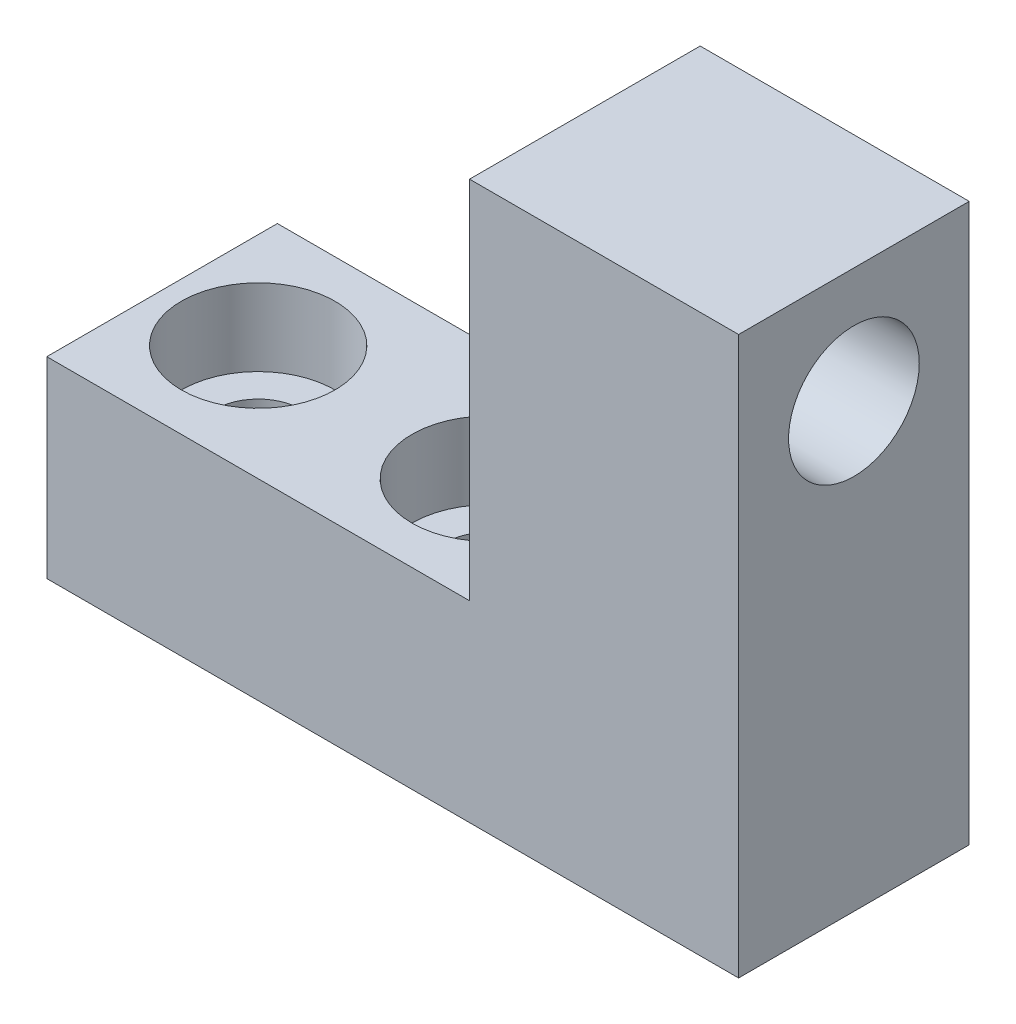
ISO-10303-21;
HEADER;
FILE_DESCRIPTION(('STEP AP214'),'2;1');
FILE_NAME('part.step','',(''),(''),'','','');
FILE_SCHEMA(('AUTOMOTIVE_DESIGN { 1 0 10303 214 1 1 1 1 }'));
ENDSEC;
DATA;
#1=APPLICATION_CONTEXT('core data for automotive mechanical design processes');
#2=APPLICATION_PROTOCOL_DEFINITION('international standard','automotive_design',2000,#1);
#3=PRODUCT_CONTEXT('',#1,'mechanical');
#4=PRODUCT('Part','Part','',(#3));
#5=PRODUCT_RELATED_PRODUCT_CATEGORY('part','',(#4));
#6=PRODUCT_DEFINITION_FORMATION('','',#4);
#7=PRODUCT_DEFINITION_CONTEXT('part definition',#1,'design');
#8=PRODUCT_DEFINITION('design','',#6,#7);
#9=PRODUCT_DEFINITION_SHAPE('','',#8);
#10=(LENGTH_UNIT() NAMED_UNIT(*) SI_UNIT(.MILLI.,.METRE.));
#11=(NAMED_UNIT(*) PLANE_ANGLE_UNIT() SI_UNIT($,.RADIAN.));
#12=(NAMED_UNIT(*) SI_UNIT($,.STERADIAN.) SOLID_ANGLE_UNIT());
#13=UNCERTAINTY_MEASURE_WITH_UNIT(LENGTH_MEASURE(1.E-05),#10,'distance_accuracy_value','');
#14=(GEOMETRIC_REPRESENTATION_CONTEXT(3) GLOBAL_UNCERTAINTY_ASSIGNED_CONTEXT((#13)) GLOBAL_UNIT_ASSIGNED_CONTEXT((#10,
#11,#12)) REPRESENTATION_CONTEXT('',''));
#15=CARTESIAN_POINT('',(0.,0.,0.));
#16=DIRECTION('',(0.,0.,1.));
#17=DIRECTION('',(1.,0.,0.));
#18=AXIS2_PLACEMENT_3D('',#15,#16,#17);
#19=CARTESIAN_POINT('',(8.72260504321214,-6.95626822157435,6.));
#20=DIRECTION('',(0.,1.,0.));
#21=DIRECTION('',(0.,0.,1.));
#22=AXIS2_PLACEMENT_3D('',#19,#20,#21);
#23=CYLINDRICAL_SURFACE('',#22,2.25);
#24=CARTESIAN_POINT('',(8.72260504321214,-6.95626822157435,6.));
#25=DIRECTION('',(0.,1.,0.));
#26=DIRECTION('',(0.,0.,1.));
#27=AXIS2_PLACEMENT_3D('',#24,#25,#26);
#28=CIRCLE('',#27,2.25);
#29=CARTESIAN_POINT('',(8.72260504321214,-6.95626822157435,8.25));
#30=VERTEX_POINT('',#29);
#31=EDGE_CURVE('E146',#30,#30,#28,.T.);
#32=ORIENTED_EDGE('',*,*,#31,.F.);
#33=EDGE_LOOP('',(#32));
#34=FACE_BOUND('',#33,.T.);
#35=CARTESIAN_POINT('',(8.72260504321214,-0.956268221574349,6.));
#36=DIRECTION('',(0.,1.,0.));
#37=DIRECTION('',(0.,0.,1.));
#38=AXIS2_PLACEMENT_3D('',#35,#36,#37);
#39=CIRCLE('',#38,2.25);
#40=CARTESIAN_POINT('',(8.72260504321214,-0.956268221574349,8.25));
#41=VERTEX_POINT('',#40);
#42=EDGE_CURVE('E39',#41,#41,#39,.F.);
#43=ORIENTED_EDGE('',*,*,#42,.F.);
#44=EDGE_LOOP('',(#43));
#45=FACE_BOUND('',#44,.T.);
#46=ADVANCED_FACE('F35',(#34,#45),#23,.F.);
#47=CARTESIAN_POINT('',(-3.27739495678786,-6.95626822157435,6.));
#48=DIRECTION('',(0.,1.,0.));
#49=DIRECTION('',(0.,0.,1.));
#50=AXIS2_PLACEMENT_3D('',#47,#48,#49);
#51=CYLINDRICAL_SURFACE('',#50,2.25);
#52=CARTESIAN_POINT('',(-3.27739495678786,-6.95626822157435,6.));
#53=DIRECTION('',(0.,1.,0.));
#54=DIRECTION('',(0.,0.,1.));
#55=AXIS2_PLACEMENT_3D('',#52,#53,#54);
#56=CIRCLE('',#55,2.25);
#57=CARTESIAN_POINT('',(-3.27739495678786,-6.95626822157435,8.25));
#58=VERTEX_POINT('',#57);
#59=EDGE_CURVE('E121',#58,#58,#56,.T.);
#60=ORIENTED_EDGE('',*,*,#59,.F.);
#61=EDGE_LOOP('',(#60));
#62=FACE_BOUND('',#61,.T.);
#63=CARTESIAN_POINT('',(-3.27739495678786,-0.956268221574349,6.));
#64=DIRECTION('',(0.,1.,0.));
#65=DIRECTION('',(0.,0.,1.));
#66=AXIS2_PLACEMENT_3D('',#63,#64,#65);
#67=CIRCLE('',#66,2.25);
#68=CARTESIAN_POINT('',(-3.27739495678786,-0.956268221574349,8.25));
#69=VERTEX_POINT('',#68);
#70=EDGE_CURVE('E144',#69,#69,#67,.F.);
#71=ORIENTED_EDGE('',*,*,#70,.F.);
#72=EDGE_LOOP('',(#71));
#73=FACE_BOUND('',#72,.T.);
#74=ADVANCED_FACE('F187',(#62,#73),#51,.F.);
#75=CARTESIAN_POINT('',(-8.27739495678786,3.04373177842565,12.));
#76=DIRECTION('',(0.,-1.,0.));
#77=DIRECTION('',(0.,0.,-1.));
#78=AXIS2_PLACEMENT_3D('',#75,#76,#77);
#79=PLANE('',#78);
#80=CARTESIAN_POINT('',(8.72260504321214,3.04373177842565,6.));
#81=DIRECTION('',(0.,1.,0.));
#82=DIRECTION('',(0.,0.,1.));
#83=AXIS2_PLACEMENT_3D('',#80,#81,#82);
#84=CIRCLE('',#83,4.);
#85=CARTESIAN_POINT('',(8.72260504321214,3.04373177842565,10.));
#86=VERTEX_POINT('',#85);
#87=EDGE_CURVE('E159',#86,#86,#84,.T.);
#88=ORIENTED_EDGE('',*,*,#87,.F.);
#89=EDGE_LOOP('',(#88));
#90=FACE_BOUND('',#89,.T.);
#91=CARTESIAN_POINT('',(-3.27739495678786,3.04373177842565,6.));
#92=DIRECTION('',(0.,1.,0.));
#93=DIRECTION('',(0.,0.,1.));
#94=AXIS2_PLACEMENT_3D('',#91,#92,#93);
#95=CIRCLE('',#94,4.);
#96=CARTESIAN_POINT('',(-3.27739495678786,3.04373177842565,10.));
#97=VERTEX_POINT('',#96);
#98=EDGE_CURVE('E152',#97,#97,#95,.T.);
#99=ORIENTED_EDGE('',*,*,#98,.F.);
#100=EDGE_LOOP('',(#99));
#101=FACE_BOUND('',#100,.T.);
#102=DIRECTION('',(0.,0.,1.));
#103=VECTOR('',#102,1.);
#104=CARTESIAN_POINT('',(13.7226050432121,3.04373177842565,12.));
#105=LINE('',#104,#103);
#106=CARTESIAN_POINT('',(13.7226050432121,3.04373177842565,0.));
#107=VERTEX_POINT('',#106);
#108=CARTESIAN_POINT('',(13.7226050432121,3.04373177842565,12.));
#109=VERTEX_POINT('',#108);
#110=EDGE_CURVE('E52',#107,#109,#105,.T.);
#111=ORIENTED_EDGE('',*,*,#110,.F.);
#112=DIRECTION('',(-1.,0.,0.));
#113=VECTOR('',#112,1.);
#114=CARTESIAN_POINT('',(-8.27739495678786,3.04373177842565,0.));
#115=LINE('',#114,#113);
#116=CARTESIAN_POINT('',(-8.27739495678786,3.04373177842565,0.));
#117=VERTEX_POINT('',#116);
#118=EDGE_CURVE('E74',#107,#117,#115,.T.);
#119=ORIENTED_EDGE('',*,*,#118,.T.);
#120=DIRECTION('',(0.,0.,-1.));
#121=VECTOR('',#120,1.);
#122=CARTESIAN_POINT('',(-8.27739495678786,3.04373177842565,12.));
#123=LINE('',#122,#121);
#124=CARTESIAN_POINT('',(-8.27739495678786,3.04373177842565,12.));
#125=VERTEX_POINT('',#124);
#126=EDGE_CURVE('E138',#125,#117,#123,.T.);
#127=ORIENTED_EDGE('',*,*,#126,.F.);
#128=DIRECTION('',(-1.,0.,0.));
#129=VECTOR('',#128,1.);
#130=CARTESIAN_POINT('',(-8.27739495678786,3.04373177842565,12.));
#131=LINE('',#130,#129);
#132=EDGE_CURVE('E60',#109,#125,#131,.T.);
#133=ORIENTED_EDGE('',*,*,#132,.F.);
#134=EDGE_LOOP('',(#111,#119,#127,#133));
#135=FACE_BOUND('',#134,.T.);
#136=ADVANCED_FACE('F193',(#90,#101,#135),#79,.F.);
#137=CARTESIAN_POINT('',(-8.27739495678786,3.04373177842565,12.));
#138=DIRECTION('',(1.,0.,0.));
#139=DIRECTION('',(0.,1.,0.));
#140=AXIS2_PLACEMENT_3D('',#137,#138,#139);
#141=PLANE('',#140);
#142=DIRECTION('',(0.,-1.,0.));
#143=VECTOR('',#142,1.);
#144=CARTESIAN_POINT('',(-8.27739495678786,3.04373177842565,0.));
#145=LINE('',#144,#143);
#146=CARTESIAN_POINT('',(-8.27739495678786,-6.95626822157435,0.));
#147=VERTEX_POINT('',#146);
#148=EDGE_CURVE('E131',#117,#147,#145,.T.);
#149=ORIENTED_EDGE('',*,*,#148,.T.);
#150=DIRECTION('',(0.,0.,-1.));
#151=VECTOR('',#150,1.);
#152=CARTESIAN_POINT('',(-8.27739495678786,-6.95626822157435,12.));
#153=LINE('',#152,#151);
#154=CARTESIAN_POINT('',(-8.27739495678786,-6.95626822157435,12.));
#155=VERTEX_POINT('',#154);
#156=EDGE_CURVE('E11',#155,#147,#153,.T.);
#157=ORIENTED_EDGE('',*,*,#156,.F.);
#158=DIRECTION('',(0.,-1.,0.));
#159=VECTOR('',#158,1.);
#160=CARTESIAN_POINT('',(-8.27739495678786,3.04373177842565,12.));
#161=LINE('',#160,#159);
#162=EDGE_CURVE('E132',#125,#155,#161,.T.);
#163=ORIENTED_EDGE('',*,*,#162,.F.);
#164=ORIENTED_EDGE('',*,*,#126,.T.);
#165=EDGE_LOOP('',(#149,#157,#163,#164));
#166=FACE_BOUND('',#165,.T.);
#167=ADVANCED_FACE('F37',(#166),#141,.F.);
#168=CARTESIAN_POINT('',(-8.27739495678786,-6.95626822157435,12.));
#169=DIRECTION('',(0.,1.,0.));
#170=DIRECTION('',(0.,0.,1.));
#171=AXIS2_PLACEMENT_3D('',#168,#169,#170);
#172=PLANE('',#171);
#173=ORIENTED_EDGE('',*,*,#31,.T.);
#174=EDGE_LOOP('',(#173));
#175=FACE_BOUND('',#174,.T.);
#176=ORIENTED_EDGE('',*,*,#59,.T.);
#177=EDGE_LOOP('',(#176));
#178=FACE_BOUND('',#177,.T.);
#179=DIRECTION('',(1.,0.,0.));
#180=VECTOR('',#179,1.);
#181=CARTESIAN_POINT('',(-8.27739495678786,-6.95626822157435,0.));
#182=LINE('',#181,#180);
#183=CARTESIAN_POINT('',(27.7226050432121,-6.95626822157435,0.));
#184=VERTEX_POINT('',#183);
#185=EDGE_CURVE('E104',#147,#184,#182,.T.);
#186=ORIENTED_EDGE('',*,*,#185,.T.);
#187=DIRECTION('',(0.,0.,-1.));
#188=VECTOR('',#187,1.);
#189=CARTESIAN_POINT('',(27.7226050432121,-6.95626822157435,12.));
#190=LINE('',#189,#188);
#191=CARTESIAN_POINT('',(27.7226050432121,-6.95626822157435,12.));
#192=VERTEX_POINT('',#191);
#193=EDGE_CURVE('E44',#192,#184,#190,.T.);
#194=ORIENTED_EDGE('',*,*,#193,.F.);
#195=DIRECTION('',(1.,0.,0.));
#196=VECTOR('',#195,1.);
#197=CARTESIAN_POINT('',(-8.27739495678786,-6.95626822157435,12.));
#198=LINE('',#197,#196);
#199=EDGE_CURVE('E79',#155,#192,#198,.T.);
#200=ORIENTED_EDGE('',*,*,#199,.F.);
#201=ORIENTED_EDGE('',*,*,#156,.T.);
#202=EDGE_LOOP('',(#186,#194,#200,#201));
#203=FACE_BOUND('',#202,.T.);
#204=ADVANCED_FACE('F177',(#175,#178,#203),#172,.F.);
#205=CARTESIAN_POINT('',(27.7226050432121,3.04373177842565,12.));
#206=DIRECTION('',(-1.,0.,0.));
#207=DIRECTION('',(0.,-1.,0.));
#208=AXIS2_PLACEMENT_3D('',#205,#206,#207);
#209=PLANE('',#208);
#210=CARTESIAN_POINT('',(27.7226050432121,16.0437317784257,6.));
#211=DIRECTION('',(1.,0.,0.));
#212=DIRECTION('',(0.,0.,-1.));
#213=AXIS2_PLACEMENT_3D('',#210,#211,#212);
#214=CIRCLE('',#213,3.4);
#215=CARTESIAN_POINT('',(27.7226050432121,16.0437317784257,2.6));
#216=VERTEX_POINT('',#215);
#217=EDGE_CURVE('E168',#216,#216,#214,.T.);
#218=ORIENTED_EDGE('',*,*,#217,.F.);
#219=EDGE_LOOP('',(#218));
#220=FACE_BOUND('',#219,.T.);
#221=DIRECTION('',(0.,1.,0.));
#222=VECTOR('',#221,1.);
#223=CARTESIAN_POINT('',(27.7226050432121,3.04373177842565,0.));
#224=LINE('',#223,#222);
#225=CARTESIAN_POINT('',(27.7226050432121,22.0437317784257,0.));
#226=VERTEX_POINT('',#225);
#227=EDGE_CURVE('E97',#184,#226,#224,.T.);
#228=ORIENTED_EDGE('',*,*,#227,.T.);
#229=DIRECTION('',(0.,0.,-1.));
#230=VECTOR('',#229,1.);
#231=CARTESIAN_POINT('',(27.7226050432121,22.0437317784257,12.));
#232=LINE('',#231,#230);
#233=CARTESIAN_POINT('',(27.7226050432121,22.0437317784257,12.));
#234=VERTEX_POINT('',#233);
#235=EDGE_CURVE('E102',#234,#226,#232,.T.);
#236=ORIENTED_EDGE('',*,*,#235,.F.);
#237=DIRECTION('',(0.,1.,0.));
#238=VECTOR('',#237,1.);
#239=CARTESIAN_POINT('',(27.7226050432121,3.04373177842565,12.));
#240=LINE('',#239,#238);
#241=EDGE_CURVE('E135',#192,#234,#240,.T.);
#242=ORIENTED_EDGE('',*,*,#241,.F.);
#243=ORIENTED_EDGE('',*,*,#193,.T.);
#244=EDGE_LOOP('',(#228,#236,#242,#243));
#245=FACE_BOUND('',#244,.T.);
#246=ADVANCED_FACE('F99',(#220,#245),#209,.F.);
#247=CARTESIAN_POINT('',(0.,0.,12.));
#248=DIRECTION('',(0.,0.,1.));
#249=DIRECTION('',(1.,0.,0.));
#250=AXIS2_PLACEMENT_3D('',#247,#248,#249);
#251=PLANE('',#250);
#252=ORIENTED_EDGE('',*,*,#162,.T.);
#253=ORIENTED_EDGE('',*,*,#199,.T.);
#254=ORIENTED_EDGE('',*,*,#241,.T.);
#255=DIRECTION('',(1.,0.,0.));
#256=VECTOR('',#255,1.);
#257=CARTESIAN_POINT('',(27.7226050432121,22.0437317784257,12.));
#258=LINE('',#257,#256);
#259=CARTESIAN_POINT('',(13.7226050432121,22.0437317784257,12.));
#260=VERTEX_POINT('',#259);
#261=EDGE_CURVE('E119',#260,#234,#258,.T.);
#262=ORIENTED_EDGE('',*,*,#261,.F.);
#263=DIRECTION('',(0.,-1.,0.));
#264=VECTOR('',#263,1.);
#265=CARTESIAN_POINT('',(13.7226050432121,22.0437317784257,12.));
#266=LINE('',#265,#264);
#267=EDGE_CURVE('E127',#260,#109,#266,.T.);
#268=ORIENTED_EDGE('',*,*,#267,.T.);
#269=ORIENTED_EDGE('',*,*,#132,.T.);
#270=EDGE_LOOP('',(#252,#253,#254,#262,#268,#269));
#271=FACE_BOUND('',#270,.T.);
#272=ADVANCED_FACE('F176',(#271),#251,.T.);
#273=CARTESIAN_POINT('',(0.,0.,0.));
#274=DIRECTION('',(0.,0.,1.));
#275=DIRECTION('',(1.,0.,0.));
#276=AXIS2_PLACEMENT_3D('',#273,#274,#275);
#277=PLANE('',#276);
#278=ORIENTED_EDGE('',*,*,#148,.F.);
#279=ORIENTED_EDGE('',*,*,#118,.F.);
#280=DIRECTION('',(0.,-1.,0.));
#281=VECTOR('',#280,1.);
#282=CARTESIAN_POINT('',(13.7226050432121,22.0437317784257,0.));
#283=LINE('',#282,#281);
#284=CARTESIAN_POINT('',(13.7226050432121,22.0437317784257,0.));
#285=VERTEX_POINT('',#284);
#286=EDGE_CURVE('E111',#285,#107,#283,.T.);
#287=ORIENTED_EDGE('',*,*,#286,.F.);
#288=DIRECTION('',(-1.,0.,0.));
#289=VECTOR('',#288,1.);
#290=CARTESIAN_POINT('',(27.7226050432121,22.0437317784257,0.));
#291=LINE('',#290,#289);
#292=EDGE_CURVE('E107',#226,#285,#291,.T.);
#293=ORIENTED_EDGE('',*,*,#292,.F.);
#294=ORIENTED_EDGE('',*,*,#227,.F.);
#295=ORIENTED_EDGE('',*,*,#185,.F.);
#296=EDGE_LOOP('',(#278,#279,#287,#293,#294,#295));
#297=FACE_BOUND('',#296,.T.);
#298=ADVANCED_FACE('F109',(#297),#277,.F.);
#299=CARTESIAN_POINT('',(13.7226050432121,22.0437317784257,12.));
#300=DIRECTION('',(1.,0.,0.));
#301=DIRECTION('',(0.,0.,-1.));
#302=AXIS2_PLACEMENT_3D('',#299,#300,#301);
#303=PLANE('',#302);
#304=CARTESIAN_POINT('',(13.7226050432121,16.0437317784257,6.));
#305=DIRECTION('',(1.,0.,0.));
#306=DIRECTION('',(0.,0.,-1.));
#307=AXIS2_PLACEMENT_3D('',#304,#305,#306);
#308=CIRCLE('',#307,3.4);
#309=CARTESIAN_POINT('',(13.7226050432121,16.0437317784257,2.6));
#310=VERTEX_POINT('',#309);
#311=EDGE_CURVE('E163',#310,#310,#308,.T.);
#312=ORIENTED_EDGE('',*,*,#311,.T.);
#313=EDGE_LOOP('',(#312));
#314=FACE_BOUND('',#313,.T.);
#315=ORIENTED_EDGE('',*,*,#110,.T.);
#316=ORIENTED_EDGE('',*,*,#267,.F.);
#317=DIRECTION('',(0.,0.,1.));
#318=VECTOR('',#317,1.);
#319=CARTESIAN_POINT('',(13.7226050432121,22.0437317784257,12.));
#320=LINE('',#319,#318);
#321=EDGE_CURVE('E114',#285,#260,#320,.T.);
#322=ORIENTED_EDGE('',*,*,#321,.F.);
#323=ORIENTED_EDGE('',*,*,#286,.T.);
#324=EDGE_LOOP('',(#315,#316,#322,#323));
#325=FACE_BOUND('',#324,.T.);
#326=ADVANCED_FACE('F205',(#314,#325),#303,.F.);
#327=CARTESIAN_POINT('',(0.,22.0437317784257,0.));
#328=DIRECTION('',(0.,1.,0.));
#329=DIRECTION('',(0.,0.,1.));
#330=AXIS2_PLACEMENT_3D('',#327,#328,#329);
#331=PLANE('',#330);
#332=ORIENTED_EDGE('',*,*,#235,.T.);
#333=ORIENTED_EDGE('',*,*,#292,.T.);
#334=ORIENTED_EDGE('',*,*,#321,.T.);
#335=ORIENTED_EDGE('',*,*,#261,.T.);
#336=EDGE_LOOP('',(#332,#333,#334,#335));
#337=FACE_BOUND('',#336,.T.);
#338=ADVANCED_FACE('F117',(#337),#331,.T.);
#339=CARTESIAN_POINT('',(-3.27739495678786,-0.956268221574348,6.));
#340=DIRECTION('',(0.,1.,0.));
#341=DIRECTION('',(0.,0.,1.));
#342=AXIS2_PLACEMENT_3D('',#339,#340,#341);
#343=PLANE('',#342);
#344=CARTESIAN_POINT('',(-3.27739495678786,-0.956268221574348,6.));
#345=DIRECTION('',(0.,1.,0.));
#346=DIRECTION('',(0.,0.,1.));
#347=AXIS2_PLACEMENT_3D('',#344,#345,#346);
#348=CIRCLE('',#347,4.);
#349=CARTESIAN_POINT('',(-3.27739495678786,-0.956268221574348,10.));
#350=VERTEX_POINT('',#349);
#351=EDGE_CURVE('E147',#350,#350,#348,.T.);
#352=ORIENTED_EDGE('',*,*,#351,.T.);
#353=EDGE_LOOP('',(#352));
#354=FACE_BOUND('',#353,.T.);
#355=ORIENTED_EDGE('',*,*,#70,.T.);
#356=EDGE_LOOP('',(#355));
#357=FACE_BOUND('',#356,.T.);
#358=ADVANCED_FACE('F204',(#354,#357),#343,.T.);
#359=CARTESIAN_POINT('',(-3.27739495678786,-0.956268221574348,6.));
#360=DIRECTION('',(0.,1.,0.));
#361=DIRECTION('',(0.,0.,1.));
#362=AXIS2_PLACEMENT_3D('',#359,#360,#361);
#363=CYLINDRICAL_SURFACE('',#362,4.);
#364=ORIENTED_EDGE('',*,*,#351,.F.);
#365=EDGE_LOOP('',(#364));
#366=FACE_BOUND('',#365,.T.);
#367=ORIENTED_EDGE('',*,*,#98,.T.);
#368=EDGE_LOOP('',(#367));
#369=FACE_BOUND('',#368,.T.);
#370=ADVANCED_FACE('F199',(#366,#369),#363,.F.);
#371=CARTESIAN_POINT('',(8.72260504321214,-0.956268221574348,6.));
#372=DIRECTION('',(0.,1.,0.));
#373=DIRECTION('',(0.,0.,1.));
#374=AXIS2_PLACEMENT_3D('',#371,#372,#373);
#375=PLANE('',#374);
#376=CARTESIAN_POINT('',(8.72260504321214,-0.956268221574348,6.));
#377=DIRECTION('',(0.,1.,0.));
#378=DIRECTION('',(0.,0.,1.));
#379=AXIS2_PLACEMENT_3D('',#376,#377,#378);
#380=CIRCLE('',#379,4.);
#381=CARTESIAN_POINT('',(8.72260504321214,-0.956268221574348,10.));
#382=VERTEX_POINT('',#381);
#383=EDGE_CURVE('E162',#382,#382,#380,.T.);
#384=ORIENTED_EDGE('',*,*,#383,.T.);
#385=EDGE_LOOP('',(#384));
#386=FACE_BOUND('',#385,.T.);
#387=ORIENTED_EDGE('',*,*,#42,.T.);
#388=EDGE_LOOP('',(#387));
#389=FACE_BOUND('',#388,.T.);
#390=ADVANCED_FACE('F221',(#386,#389),#375,.T.);
#391=CARTESIAN_POINT('',(8.72260504321214,-0.956268221574348,6.));
#392=DIRECTION('',(0.,1.,0.));
#393=DIRECTION('',(0.,0.,1.));
#394=AXIS2_PLACEMENT_3D('',#391,#392,#393);
#395=CYLINDRICAL_SURFACE('',#394,4.);
#396=ORIENTED_EDGE('',*,*,#383,.F.);
#397=EDGE_LOOP('',(#396));
#398=FACE_BOUND('',#397,.T.);
#399=ORIENTED_EDGE('',*,*,#87,.T.);
#400=EDGE_LOOP('',(#399));
#401=FACE_BOUND('',#400,.T.);
#402=ADVANCED_FACE('F227',(#398,#401),#395,.F.);
#403=CARTESIAN_POINT('',(27.7226050432121,16.0437317784257,6.));
#404=DIRECTION('',(1.,0.,0.));
#405=DIRECTION('',(0.,0.,-1.));
#406=AXIS2_PLACEMENT_3D('',#403,#404,#405);
#407=CYLINDRICAL_SURFACE('',#406,3.4);
#408=ORIENTED_EDGE('',*,*,#217,.T.);
#409=EDGE_LOOP('',(#408));
#410=FACE_BOUND('',#409,.T.);
#411=ORIENTED_EDGE('',*,*,#311,.F.);
#412=EDGE_LOOP('',(#411));
#413=FACE_BOUND('',#412,.T.);
#414=ADVANCED_FACE('F172',(#410,#413),#407,.F.);
#415=CLOSED_SHELL('',(#46,#74,#136,#167,#204,#246,#272,#298,#326,#338,#358,#370,#390,#402,#414));
#416=MANIFOLD_SOLID_BREP('B2',#415);
#417=ADVANCED_BREP_SHAPE_REPRESENTATION('',(#18,#416),#14);
#418=SHAPE_DEFINITION_REPRESENTATION(#9,#417);
ENDSEC;
END-ISO-10303-21;
